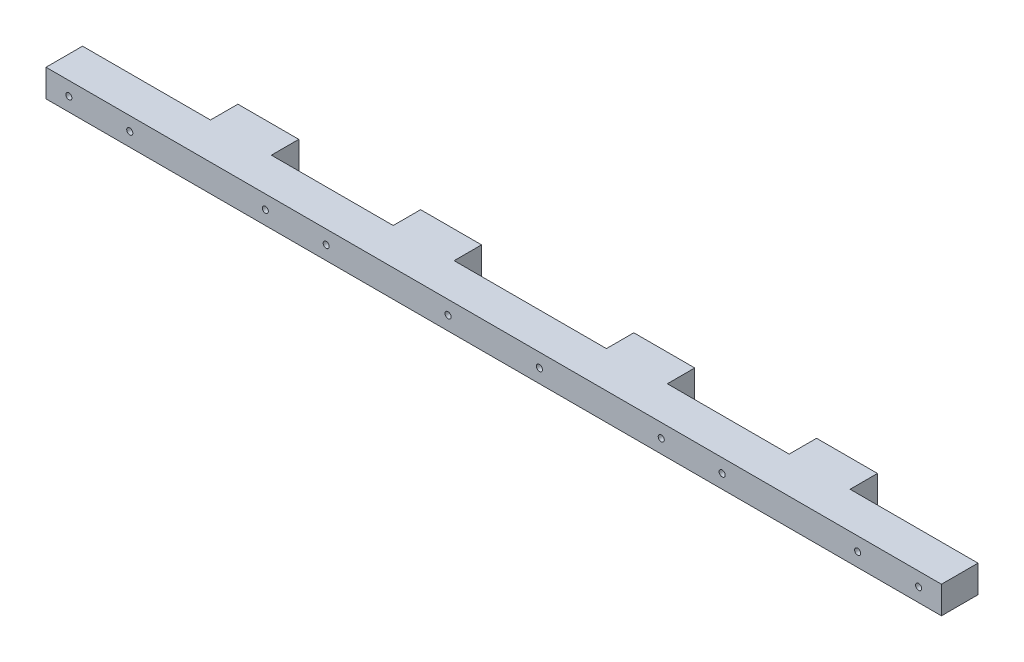
ISO-10303-21;
HEADER;
FILE_DESCRIPTION(('STEP AP214'),'2;1');
FILE_NAME('part.step','',(''),(''),'','','');
FILE_SCHEMA(('AUTOMOTIVE_DESIGN { 1 0 10303 214 1 1 1 1 }'));
ENDSEC;
DATA;
#1=APPLICATION_CONTEXT('core data for automotive mechanical design processes');
#2=APPLICATION_PROTOCOL_DEFINITION('international standard','automotive_design',2000,#1);
#3=PRODUCT_CONTEXT('',#1,'mechanical');
#4=PRODUCT('Part','Part','',(#3));
#5=PRODUCT_RELATED_PRODUCT_CATEGORY('part','',(#4));
#6=PRODUCT_DEFINITION_FORMATION('','',#4);
#7=PRODUCT_DEFINITION_CONTEXT('part definition',#1,'design');
#8=PRODUCT_DEFINITION('design','',#6,#7);
#9=PRODUCT_DEFINITION_SHAPE('','',#8);
#10=(LENGTH_UNIT() NAMED_UNIT(*) SI_UNIT(.MILLI.,.METRE.));
#11=(NAMED_UNIT(*) PLANE_ANGLE_UNIT() SI_UNIT($,.RADIAN.));
#12=(NAMED_UNIT(*) SI_UNIT($,.STERADIAN.) SOLID_ANGLE_UNIT());
#13=UNCERTAINTY_MEASURE_WITH_UNIT(LENGTH_MEASURE(1.E-05),#10,'distance_accuracy_value','');
#14=(GEOMETRIC_REPRESENTATION_CONTEXT(3) GLOBAL_UNCERTAINTY_ASSIGNED_CONTEXT((#13)) GLOBAL_UNIT_ASSIGNED_CONTEXT((#10,
#11,#12)) REPRESENTATION_CONTEXT('',''));
#15=CARTESIAN_POINT('',(0.,0.,0.));
#16=DIRECTION('',(0.,0.,1.));
#17=DIRECTION('',(1.,0.,0.));
#18=AXIS2_PLACEMENT_3D('',#15,#16,#17);
#19=CARTESIAN_POINT('',(0.,0.,9.));
#20=DIRECTION('',(0.,0.,-1.));
#21=DIRECTION('',(-1.,0.,0.));
#22=AXIS2_PLACEMENT_3D('',#19,#20,#21);
#23=PLANE('',#22);
#24=CARTESIAN_POINT('',(-139.5,10.5,9.));
#25=DIRECTION('',(0.,0.,1.));
#26=DIRECTION('',(1.,0.,0.));
#27=AXIS2_PLACEMENT_3D('',#24,#25,#26);
#28=CIRCLE('',#27,0.999999999999998);
#29=CARTESIAN_POINT('',(-138.5,10.5,9.));
#30=VERTEX_POINT('',#29);
#31=EDGE_CURVE('E324',#30,#30,#28,.T.);
#32=ORIENTED_EDGE('',*,*,#31,.T.);
#33=EDGE_LOOP('',(#32));
#34=FACE_BOUND('',#33,.T.);
#35=CARTESIAN_POINT('',(-119.5,10.5,9.));
#36=DIRECTION('',(0.,0.,1.));
#37=DIRECTION('',(1.,0.,0.));
#38=AXIS2_PLACEMENT_3D('',#35,#36,#37);
#39=CIRCLE('',#38,0.999999999999998);
#40=CARTESIAN_POINT('',(-118.5,10.5,9.));
#41=VERTEX_POINT('',#40);
#42=EDGE_CURVE('E301',#41,#41,#39,.T.);
#43=ORIENTED_EDGE('',*,*,#42,.T.);
#44=EDGE_LOOP('',(#43));
#45=FACE_BOUND('',#44,.T.);
#46=DIRECTION('',(-1.,0.,0.));
#47=VECTOR('',#46,1.);
#48=CARTESIAN_POINT('',(0.,15.,9.));
#49=LINE('',#48,#47);
#50=CARTESIAN_POINT('',(-105.,15.,9.));
#51=VERTEX_POINT('',#50);
#52=CARTESIAN_POINT('',(-147.,15.,9.));
#53=VERTEX_POINT('',#52);
#54=EDGE_CURVE('E291',#51,#53,#49,.T.);
#55=ORIENTED_EDGE('',*,*,#54,.F.);
#56=DIRECTION('',(0.,1.,0.));
#57=VECTOR('',#56,1.);
#58=CARTESIAN_POINT('',(-105.,0.,9.));
#59=LINE('',#58,#57);
#60=CARTESIAN_POINT('',(-105.,5.99999999999998,9.));
#61=VERTEX_POINT('',#60);
#62=EDGE_CURVE('E176',#61,#51,#59,.T.);
#63=ORIENTED_EDGE('',*,*,#62,.F.);
#64=DIRECTION('',(-1.,0.,0.));
#65=VECTOR('',#64,1.);
#66=CARTESIAN_POINT('',(0.,5.99999999999998,9.));
#67=LINE('',#66,#65);
#68=CARTESIAN_POINT('',(-147.,5.99999999999998,9.));
#69=VERTEX_POINT('',#68);
#70=EDGE_CURVE('E300',#61,#69,#67,.T.);
#71=ORIENTED_EDGE('',*,*,#70,.T.);
#72=DIRECTION('',(0.,1.,0.));
#73=VECTOR('',#72,1.);
#74=CARTESIAN_POINT('',(-147.,-4.53341068388605E-13,9.));
#75=LINE('',#74,#73);
#76=EDGE_CURVE('E292',#69,#53,#75,.T.);
#77=ORIENTED_EDGE('',*,*,#76,.T.);
#78=EDGE_LOOP('',(#55,#63,#71,#77));
#79=FACE_BOUND('',#78,.T.);
#80=ADVANCED_FACE('F35',(#34,#45,#79),#23,.T.);
#81=DIRECTION('',(0.,1.,0.));
#82=VECTOR('',#81,1.);
#83=CARTESIAN_POINT('',(-84.9999999999999,0.,9.));
#84=LINE('',#83,#82);
#85=CARTESIAN_POINT('',(-84.9999999999999,5.99999999999998,9.00000000000001));
#86=VERTEX_POINT('',#85);
#87=CARTESIAN_POINT('',(-84.9999999999999,15.,9.));
#88=VERTEX_POINT('',#87);
#89=EDGE_CURVE('E203',#86,#88,#84,.T.);
#90=ORIENTED_EDGE('',*,*,#89,.T.);
#91=CARTESIAN_POINT('',(-44.9999999999999,15.,9.));
#92=VERTEX_POINT('',#91);
#93=EDGE_CURVE('E861',#92,#88,#49,.T.);
#94=ORIENTED_EDGE('',*,*,#93,.F.);
#95=DIRECTION('',(0.,1.,0.));
#96=VECTOR('',#95,1.);
#97=CARTESIAN_POINT('',(-44.9999999999999,0.,9.));
#98=LINE('',#97,#96);
#99=CARTESIAN_POINT('',(-44.9999999999999,5.99999999999998,9.00000000000001));
#100=VERTEX_POINT('',#99);
#101=EDGE_CURVE('E58',#100,#92,#98,.T.);
#102=ORIENTED_EDGE('',*,*,#101,.F.);
#103=EDGE_CURVE('E869',#100,#86,#67,.T.);
#104=ORIENTED_EDGE('',*,*,#103,.T.);
#105=EDGE_LOOP('',(#90,#94,#102,#104));
#106=FACE_BOUND('',#105,.T.);
#107=CARTESIAN_POINT('',(-54.9999999999999,10.5,9.));
#108=DIRECTION('',(0.,0.,1.));
#109=DIRECTION('',(1.,0.,0.));
#110=AXIS2_PLACEMENT_3D('',#107,#108,#109);
#111=CIRCLE('',#110,0.999999999999998);
#112=CARTESIAN_POINT('',(-53.9999999999999,10.5,9.));
#113=VERTEX_POINT('',#112);
#114=EDGE_CURVE('E304',#113,#113,#111,.T.);
#115=ORIENTED_EDGE('',*,*,#114,.T.);
#116=EDGE_LOOP('',(#115));
#117=FACE_BOUND('',#116,.T.);
#118=CARTESIAN_POINT('',(-74.9999999999999,10.5,9.));
#119=DIRECTION('',(0.,0.,1.));
#120=DIRECTION('',(1.,0.,0.));
#121=AXIS2_PLACEMENT_3D('',#118,#119,#120);
#122=CIRCLE('',#121,0.999999999999998);
#123=CARTESIAN_POINT('',(-73.9999999999999,10.5,9.));
#124=VERTEX_POINT('',#123);
#125=EDGE_CURVE('E295',#124,#124,#122,.T.);
#126=ORIENTED_EDGE('',*,*,#125,.T.);
#127=EDGE_LOOP('',(#126));
#128=FACE_BOUND('',#127,.T.);
#129=ADVANCED_FACE('F403',(#106,#117,#128),#23,.T.);
#130=DIRECTION('',(0.,1.,0.));
#131=VECTOR('',#130,1.);
#132=CARTESIAN_POINT('',(-24.9999999999999,0.,9.));
#133=LINE('',#132,#131);
#134=CARTESIAN_POINT('',(-24.9999999999999,5.99999999999998,9.));
#135=VERTEX_POINT('',#134);
#136=CARTESIAN_POINT('',(-24.9999999999999,15.,9.));
#137=VERTEX_POINT('',#136);
#138=EDGE_CURVE('E208',#135,#137,#133,.T.);
#139=ORIENTED_EDGE('',*,*,#138,.T.);
#140=CARTESIAN_POINT('',(24.9999999999999,15.,9.));
#141=VERTEX_POINT('',#140);
#142=EDGE_CURVE('E853',#141,#137,#49,.T.);
#143=ORIENTED_EDGE('',*,*,#142,.F.);
#144=DIRECTION('',(0.,1.,0.));
#145=VECTOR('',#144,1.);
#146=CARTESIAN_POINT('',(24.9999999999999,0.,9.));
#147=LINE('',#146,#145);
#148=CARTESIAN_POINT('',(24.9999999999999,5.99999999999998,9.00000000000001));
#149=VERTEX_POINT('',#148);
#150=EDGE_CURVE('E231',#149,#141,#147,.T.);
#151=ORIENTED_EDGE('',*,*,#150,.F.);
#152=EDGE_CURVE('E855',#149,#135,#67,.T.);
#153=ORIENTED_EDGE('',*,*,#152,.T.);
#154=EDGE_LOOP('',(#139,#143,#151,#153));
#155=FACE_BOUND('',#154,.T.);
#156=CARTESIAN_POINT('',(-14.9999999999999,10.5,9.));
#157=DIRECTION('',(0.,0.,1.));
#158=DIRECTION('',(1.,0.,0.));
#159=AXIS2_PLACEMENT_3D('',#156,#157,#158);
#160=CIRCLE('',#159,1.);
#161=CARTESIAN_POINT('',(-13.9999999999999,10.5,9.));
#162=VERTEX_POINT('',#161);
#163=EDGE_CURVE('E313',#162,#162,#160,.T.);
#164=ORIENTED_EDGE('',*,*,#163,.T.);
#165=EDGE_LOOP('',(#164));
#166=FACE_BOUND('',#165,.T.);
#167=CARTESIAN_POINT('',(14.9999999999999,10.5,9.));
#168=DIRECTION('',(0.,0.,1.));
#169=DIRECTION('',(1.,0.,0.));
#170=AXIS2_PLACEMENT_3D('',#167,#168,#169);
#171=CIRCLE('',#170,1.);
#172=CARTESIAN_POINT('',(15.9999999999999,10.5,9.));
#173=VERTEX_POINT('',#172);
#174=EDGE_CURVE('E316',#173,#173,#171,.T.);
#175=ORIENTED_EDGE('',*,*,#174,.T.);
#176=EDGE_LOOP('',(#175));
#177=FACE_BOUND('',#176,.T.);
#178=ADVANCED_FACE('F408',(#155,#166,#177),#23,.T.);
#179=CARTESIAN_POINT('',(119.5,10.5,9.));
#180=DIRECTION('',(0.,0.,1.));
#181=DIRECTION('',(1.,0.,0.));
#182=AXIS2_PLACEMENT_3D('',#179,#180,#181);
#183=CIRCLE('',#182,0.999999999999998);
#184=CARTESIAN_POINT('',(120.5,10.5,9.));
#185=VERTEX_POINT('',#184);
#186=EDGE_CURVE('E307',#185,#185,#183,.T.);
#187=ORIENTED_EDGE('',*,*,#186,.T.);
#188=EDGE_LOOP('',(#187));
#189=FACE_BOUND('',#188,.T.);
#190=CARTESIAN_POINT('',(139.5,10.5,9.));
#191=DIRECTION('',(0.,0.,1.));
#192=DIRECTION('',(1.,0.,0.));
#193=AXIS2_PLACEMENT_3D('',#190,#191,#192);
#194=CIRCLE('',#193,0.999999999999998);
#195=CARTESIAN_POINT('',(140.5,10.5,9.));
#196=VERTEX_POINT('',#195);
#197=EDGE_CURVE('E310',#196,#196,#194,.T.);
#198=ORIENTED_EDGE('',*,*,#197,.T.);
#199=EDGE_LOOP('',(#198));
#200=FACE_BOUND('',#199,.T.);
#201=CARTESIAN_POINT('',(147.,5.99999999999997,9.));
#202=VERTEX_POINT('',#201);
#203=CARTESIAN_POINT('',(105.,5.99999999999997,9.00000000000001));
#204=VERTEX_POINT('',#203);
#205=EDGE_CURVE('E296',#202,#204,#67,.T.);
#206=ORIENTED_EDGE('',*,*,#205,.T.);
#207=DIRECTION('',(0.,1.,0.));
#208=VECTOR('',#207,1.);
#209=CARTESIAN_POINT('',(105.,0.,9.));
#210=LINE('',#209,#208);
#211=CARTESIAN_POINT('',(105.,15.,9.));
#212=VERTEX_POINT('',#211);
#213=EDGE_CURVE('E258',#204,#212,#210,.T.);
#214=ORIENTED_EDGE('',*,*,#213,.T.);
#215=CARTESIAN_POINT('',(147.,15.,9.));
#216=VERTEX_POINT('',#215);
#217=EDGE_CURVE('E286',#216,#212,#49,.T.);
#218=ORIENTED_EDGE('',*,*,#217,.F.);
#219=DIRECTION('',(0.,1.,0.));
#220=VECTOR('',#219,1.);
#221=CARTESIAN_POINT('',(147.,0.,9.));
#222=LINE('',#221,#220);
#223=EDGE_CURVE('E281',#202,#216,#222,.T.);
#224=ORIENTED_EDGE('',*,*,#223,.F.);
#225=EDGE_LOOP('',(#206,#214,#218,#224));
#226=FACE_BOUND('',#225,.T.);
#227=ADVANCED_FACE('F386',(#189,#200,#226),#23,.T.);
#228=DIRECTION('',(0.,1.,0.));
#229=VECTOR('',#228,1.);
#230=CARTESIAN_POINT('',(45.,0.,9.));
#231=LINE('',#230,#229);
#232=CARTESIAN_POINT('',(44.9999999999999,5.99999999999998,9.));
#233=VERTEX_POINT('',#232);
#234=CARTESIAN_POINT('',(44.9999999999999,15.,9.));
#235=VERTEX_POINT('',#234);
#236=EDGE_CURVE('E233',#233,#235,#231,.T.);
#237=ORIENTED_EDGE('',*,*,#236,.T.);
#238=CARTESIAN_POINT('',(84.9999999999999,15.,9.));
#239=VERTEX_POINT('',#238);
#240=EDGE_CURVE('E290',#239,#235,#49,.T.);
#241=ORIENTED_EDGE('',*,*,#240,.F.);
#242=DIRECTION('',(0.,1.,0.));
#243=VECTOR('',#242,1.);
#244=CARTESIAN_POINT('',(85.,0.,9.));
#245=LINE('',#244,#243);
#246=CARTESIAN_POINT('',(84.9999999999999,5.99999999999997,9.));
#247=VERTEX_POINT('',#246);
#248=EDGE_CURVE('E256',#247,#239,#245,.T.);
#249=ORIENTED_EDGE('',*,*,#248,.F.);
#250=EDGE_CURVE('E299',#247,#233,#67,.T.);
#251=ORIENTED_EDGE('',*,*,#250,.T.);
#252=EDGE_LOOP('',(#237,#241,#249,#251));
#253=FACE_BOUND('',#252,.T.);
#254=CARTESIAN_POINT('',(74.9999999999999,10.5,9.));
#255=DIRECTION('',(0.,0.,1.));
#256=DIRECTION('',(1.,0.,0.));
#257=AXIS2_PLACEMENT_3D('',#254,#255,#256);
#258=CIRCLE('',#257,0.999999999999998);
#259=CARTESIAN_POINT('',(75.9999999999999,10.5,9.));
#260=VERTEX_POINT('',#259);
#261=EDGE_CURVE('E280',#260,#260,#258,.T.);
#262=ORIENTED_EDGE('',*,*,#261,.T.);
#263=EDGE_LOOP('',(#262));
#264=FACE_BOUND('',#263,.T.);
#265=CARTESIAN_POINT('',(54.9999999999999,10.5,9.));
#266=DIRECTION('',(0.,0.,1.));
#267=DIRECTION('',(1.,0.,0.));
#268=AXIS2_PLACEMENT_3D('',#265,#266,#267);
#269=CIRCLE('',#268,0.999999999999998);
#270=CARTESIAN_POINT('',(55.9999999999999,10.5,9.));
#271=VERTEX_POINT('',#270);
#272=EDGE_CURVE('E319',#271,#271,#269,.T.);
#273=ORIENTED_EDGE('',*,*,#272,.T.);
#274=EDGE_LOOP('',(#273));
#275=FACE_BOUND('',#274,.T.);
#276=ADVANCED_FACE('F382',(#253,#264,#275),#23,.T.);
#277=CARTESIAN_POINT('',(0.,5.99999999999998,315.137722844249));
#278=DIRECTION('',(0.,-1.,0.));
#279=DIRECTION('',(1.,0.,0.));
#280=AXIS2_PLACEMENT_3D('',#277,#278,#279);
#281=PLANE('',#280);
#282=DIRECTION('',(1.,0.,0.));
#283=VECTOR('',#282,1.);
#284=CARTESIAN_POINT('',(0.,5.99999999999998,21.));
#285=LINE('',#284,#283);
#286=CARTESIAN_POINT('',(-147.,5.99999999999998,21.));
#287=VERTEX_POINT('',#286);
#288=CARTESIAN_POINT('',(147.,5.99999999999997,21.));
#289=VERTEX_POINT('',#288);
#290=EDGE_CURVE('E336',#287,#289,#285,.T.);
#291=ORIENTED_EDGE('',*,*,#290,.F.);
#292=DIRECTION('',(0.,0.,-1.));
#293=VECTOR('',#292,1.);
#294=CARTESIAN_POINT('',(-147.,5.99999999999998,315.137722844249));
#295=LINE('',#294,#293);
#296=EDGE_CURVE('E329',#287,#69,#295,.T.);
#297=ORIENTED_EDGE('',*,*,#296,.T.);
#298=ORIENTED_EDGE('',*,*,#70,.F.);
#299=DIRECTION('',(0.,0.,-1.));
#300=VECTOR('',#299,1.);
#301=CARTESIAN_POINT('',(-105.,5.99999999999998,30.9317121994613));
#302=LINE('',#301,#300);
#303=CARTESIAN_POINT('',(-105.,5.99999999999998,0.));
#304=VERTEX_POINT('',#303);
#305=EDGE_CURVE('E178',#61,#304,#302,.T.);
#306=ORIENTED_EDGE('',*,*,#305,.T.);
#307=DIRECTION('',(1.,0.,0.));
#308=VECTOR('',#307,1.);
#309=CARTESIAN_POINT('',(0.,5.99999999999998,0.));
#310=LINE('',#309,#308);
#311=CARTESIAN_POINT('',(-84.9999999999999,5.99999999999998,0.));
#312=VERTEX_POINT('',#311);
#313=EDGE_CURVE('E187',#304,#312,#310,.T.);
#314=ORIENTED_EDGE('',*,*,#313,.T.);
#315=DIRECTION('',(0.,0.,-1.));
#316=VECTOR('',#315,1.);
#317=CARTESIAN_POINT('',(-84.9999999999999,5.99999999999998,30.9317121994613));
#318=LINE('',#317,#316);
#319=EDGE_CURVE('E200',#86,#312,#318,.T.);
#320=ORIENTED_EDGE('',*,*,#319,.F.);
#321=ORIENTED_EDGE('',*,*,#103,.F.);
#322=DIRECTION('',(0.,0.,-1.));
#323=VECTOR('',#322,1.);
#324=CARTESIAN_POINT('',(-44.9999999999999,5.99999999999998,30.9317121994613));
#325=LINE('',#324,#323);
#326=CARTESIAN_POINT('',(-44.9999999999999,5.99999999999998,0.));
#327=VERTEX_POINT('',#326);
#328=EDGE_CURVE('E226',#100,#327,#325,.T.);
#329=ORIENTED_EDGE('',*,*,#328,.T.);
#330=DIRECTION('',(1.,0.,0.));
#331=VECTOR('',#330,1.);
#332=CARTESIAN_POINT('',(0.,5.99999999999998,0.));
#333=LINE('',#332,#331);
#334=CARTESIAN_POINT('',(-24.9999999999999,5.99999999999998,0.));
#335=VERTEX_POINT('',#334);
#336=EDGE_CURVE('E221',#327,#335,#333,.T.);
#337=ORIENTED_EDGE('',*,*,#336,.T.);
#338=DIRECTION('',(0.,0.,-1.));
#339=VECTOR('',#338,1.);
#340=CARTESIAN_POINT('',(-24.9999999999999,5.99999999999998,30.9317121994613));
#341=LINE('',#340,#339);
#342=EDGE_CURVE('E224',#135,#335,#341,.T.);
#343=ORIENTED_EDGE('',*,*,#342,.F.);
#344=ORIENTED_EDGE('',*,*,#152,.F.);
#345=DIRECTION('',(0.,0.,-1.));
#346=VECTOR('',#345,1.);
#347=CARTESIAN_POINT('',(24.9999999999999,5.99999999999998,30.9317121994613));
#348=LINE('',#347,#346);
#349=CARTESIAN_POINT('',(24.9999999999999,5.99999999999998,0.));
#350=VERTEX_POINT('',#349);
#351=EDGE_CURVE('E251',#149,#350,#348,.T.);
#352=ORIENTED_EDGE('',*,*,#351,.T.);
#353=DIRECTION('',(1.,0.,0.));
#354=VECTOR('',#353,1.);
#355=CARTESIAN_POINT('',(0.,5.99999999999998,0.));
#356=LINE('',#355,#354);
#357=CARTESIAN_POINT('',(44.9999999999999,5.99999999999998,0.));
#358=VERTEX_POINT('',#357);
#359=EDGE_CURVE('E246',#350,#358,#356,.T.);
#360=ORIENTED_EDGE('',*,*,#359,.T.);
#361=DIRECTION('',(0.,0.,-1.));
#362=VECTOR('',#361,1.);
#363=CARTESIAN_POINT('',(44.9999999999999,5.99999999999998,30.9317121994613));
#364=LINE('',#363,#362);
#365=EDGE_CURVE('E249',#233,#358,#364,.T.);
#366=ORIENTED_EDGE('',*,*,#365,.F.);
#367=ORIENTED_EDGE('',*,*,#250,.F.);
#368=DIRECTION('',(0.,0.,-1.));
#369=VECTOR('',#368,1.);
#370=CARTESIAN_POINT('',(84.9999999999999,5.99999999999997,30.9317121994613));
#371=LINE('',#370,#369);
#372=CARTESIAN_POINT('',(84.9999999999999,5.99999999999997,0.));
#373=VERTEX_POINT('',#372);
#374=EDGE_CURVE('E275',#247,#373,#371,.T.);
#375=ORIENTED_EDGE('',*,*,#374,.T.);
#376=DIRECTION('',(1.,0.,0.));
#377=VECTOR('',#376,1.);
#378=CARTESIAN_POINT('',(0.,5.99999999999998,0.));
#379=LINE('',#378,#377);
#380=CARTESIAN_POINT('',(105.,5.99999999999997,0.));
#381=VERTEX_POINT('',#380);
#382=EDGE_CURVE('E265',#373,#381,#379,.T.);
#383=ORIENTED_EDGE('',*,*,#382,.T.);
#384=DIRECTION('',(0.,0.,-1.));
#385=VECTOR('',#384,1.);
#386=CARTESIAN_POINT('',(105.,5.99999999999997,30.9317121994613));
#387=LINE('',#386,#385);
#388=EDGE_CURVE('E273',#204,#381,#387,.T.);
#389=ORIENTED_EDGE('',*,*,#388,.F.);
#390=ORIENTED_EDGE('',*,*,#205,.F.);
#391=DIRECTION('',(0.,0.,-1.));
#392=VECTOR('',#391,1.);
#393=CARTESIAN_POINT('',(147.,5.99999999999997,315.137722844249));
#394=LINE('',#393,#392);
#395=EDGE_CURVE('E285',#289,#202,#394,.T.);
#396=ORIENTED_EDGE('',*,*,#395,.F.);
#397=EDGE_LOOP('',(#291,#297,#298,#306,#314,#320,#321,#329,#337,#343,#344,#352,#360,#366,#367,
#375,#383,#389,#390,#396));
#398=FACE_BOUND('',#397,.T.);
#399=ADVANCED_FACE('F385',(#398),#281,.T.);
#400=CARTESIAN_POINT('',(147.,0.,315.137722844249));
#401=DIRECTION('',(-1.,0.,0.));
#402=DIRECTION('',(0.,0.,1.));
#403=AXIS2_PLACEMENT_3D('',#400,#401,#402);
#404=PLANE('',#403);
#405=DIRECTION('',(0.,0.,-1.));
#406=VECTOR('',#405,1.);
#407=CARTESIAN_POINT('',(147.,15.,315.137722844249));
#408=LINE('',#407,#406);
#409=CARTESIAN_POINT('',(147.,15.,21.));
#410=VERTEX_POINT('',#409);
#411=EDGE_CURVE('E332',#410,#216,#408,.T.);
#412=ORIENTED_EDGE('',*,*,#411,.F.);
#413=DIRECTION('',(0.,-1.,0.));
#414=VECTOR('',#413,1.);
#415=CARTESIAN_POINT('',(147.,0.,21.));
#416=LINE('',#415,#414);
#417=EDGE_CURVE('E331',#410,#289,#416,.T.);
#418=ORIENTED_EDGE('',*,*,#417,.T.);
#419=ORIENTED_EDGE('',*,*,#395,.T.);
#420=ORIENTED_EDGE('',*,*,#223,.T.);
#421=EDGE_LOOP('',(#412,#418,#419,#420));
#422=FACE_BOUND('',#421,.T.);
#423=ADVANCED_FACE('F621',(#422),#404,.F.);
#424=CARTESIAN_POINT('',(0.,15.,315.137722844249));
#425=DIRECTION('',(0.,-1.,0.));
#426=DIRECTION('',(1.,0.,0.));
#427=AXIS2_PLACEMENT_3D('',#424,#425,#426);
#428=PLANE('',#427);
#429=DIRECTION('',(0.,0.,-1.));
#430=VECTOR('',#429,1.);
#431=CARTESIAN_POINT('',(-147.,15.,315.137722844249));
#432=LINE('',#431,#430);
#433=CARTESIAN_POINT('',(-147.,15.,21.));
#434=VERTEX_POINT('',#433);
#435=EDGE_CURVE('E289',#434,#53,#432,.T.);
#436=ORIENTED_EDGE('',*,*,#435,.F.);
#437=DIRECTION('',(1.,0.,0.));
#438=VECTOR('',#437,1.);
#439=CARTESIAN_POINT('',(0.,15.,21.));
#440=LINE('',#439,#438);
#441=EDGE_CURVE('E284',#434,#410,#440,.T.);
#442=ORIENTED_EDGE('',*,*,#441,.T.);
#443=ORIENTED_EDGE('',*,*,#411,.T.);
#444=ORIENTED_EDGE('',*,*,#217,.T.);
#445=DIRECTION('',(0.,0.,-1.));
#446=VECTOR('',#445,1.);
#447=CARTESIAN_POINT('',(105.,15.,30.9317121994613));
#448=LINE('',#447,#446);
#449=CARTESIAN_POINT('',(105.,15.,0.));
#450=VERTEX_POINT('',#449);
#451=EDGE_CURVE('E271',#212,#450,#448,.T.);
#452=ORIENTED_EDGE('',*,*,#451,.T.);
#453=DIRECTION('',(-1.,0.,0.));
#454=VECTOR('',#453,1.);
#455=CARTESIAN_POINT('',(0.,15.,0.));
#456=LINE('',#455,#454);
#457=CARTESIAN_POINT('',(84.9999999999999,15.,0.));
#458=VERTEX_POINT('',#457);
#459=EDGE_CURVE('E237',#450,#458,#456,.T.);
#460=ORIENTED_EDGE('',*,*,#459,.T.);
#461=DIRECTION('',(0.,0.,-1.));
#462=VECTOR('',#461,1.);
#463=CARTESIAN_POINT('',(84.9999999999999,15.,30.9317121994613));
#464=LINE('',#463,#462);
#465=EDGE_CURVE('E259',#239,#458,#464,.T.);
#466=ORIENTED_EDGE('',*,*,#465,.F.);
#467=ORIENTED_EDGE('',*,*,#240,.T.);
#468=DIRECTION('',(0.,0.,-1.));
#469=VECTOR('',#468,1.);
#470=CARTESIAN_POINT('',(44.9999999999999,15.,30.9317121994613));
#471=LINE('',#470,#469);
#472=CARTESIAN_POINT('',(44.9999999999999,15.,0.));
#473=VERTEX_POINT('',#472);
#474=EDGE_CURVE('E234',#235,#473,#471,.T.);
#475=ORIENTED_EDGE('',*,*,#474,.T.);
#476=DIRECTION('',(1.,0.,0.));
#477=VECTOR('',#476,1.);
#478=CARTESIAN_POINT('',(0.,15.,0.));
#479=LINE('',#478,#477);
#480=CARTESIAN_POINT('',(24.9999999999999,15.,0.));
#481=VERTEX_POINT('',#480);
#482=EDGE_CURVE('E240',#481,#473,#479,.T.);
#483=ORIENTED_EDGE('',*,*,#482,.F.);
#484=DIRECTION('',(0.,0.,-1.));
#485=VECTOR('',#484,1.);
#486=CARTESIAN_POINT('',(24.9999999999999,15.,30.9317121994613));
#487=LINE('',#486,#485);
#488=EDGE_CURVE('E253',#141,#481,#487,.T.);
#489=ORIENTED_EDGE('',*,*,#488,.F.);
#490=ORIENTED_EDGE('',*,*,#142,.T.);
#491=DIRECTION('',(0.,0.,-1.));
#492=VECTOR('',#491,1.);
#493=CARTESIAN_POINT('',(-24.9999999999999,15.,30.9317121994613));
#494=LINE('',#493,#492);
#495=CARTESIAN_POINT('',(-24.9999999999999,15.,0.));
#496=VERTEX_POINT('',#495);
#497=EDGE_CURVE('E209',#137,#496,#494,.T.);
#498=ORIENTED_EDGE('',*,*,#497,.T.);
#499=DIRECTION('',(1.,0.,0.));
#500=VECTOR('',#499,1.);
#501=CARTESIAN_POINT('',(0.,15.,0.));
#502=LINE('',#501,#500);
#503=CARTESIAN_POINT('',(-44.9999999999999,15.,0.));
#504=VERTEX_POINT('',#503);
#505=EDGE_CURVE('E215',#504,#496,#502,.T.);
#506=ORIENTED_EDGE('',*,*,#505,.F.);
#507=DIRECTION('',(0.,0.,-1.));
#508=VECTOR('',#507,1.);
#509=CARTESIAN_POINT('',(-44.9999999999999,15.,30.9317121994613));
#510=LINE('',#509,#508);
#511=EDGE_CURVE('E228',#92,#504,#510,.T.);
#512=ORIENTED_EDGE('',*,*,#511,.F.);
#513=ORIENTED_EDGE('',*,*,#93,.T.);
#514=DIRECTION('',(0.,0.,-1.));
#515=VECTOR('',#514,1.);
#516=CARTESIAN_POINT('',(-84.9999999999999,15.,30.9317121994613));
#517=LINE('',#516,#515);
#518=CARTESIAN_POINT('',(-84.9999999999999,15.,0.));
#519=VERTEX_POINT('',#518);
#520=EDGE_CURVE('E192',#88,#519,#517,.T.);
#521=ORIENTED_EDGE('',*,*,#520,.T.);
#522=DIRECTION('',(1.,0.,0.));
#523=VECTOR('',#522,1.);
#524=CARTESIAN_POINT('',(0.,15.,0.));
#525=LINE('',#524,#523);
#526=CARTESIAN_POINT('',(-105.,15.,0.));
#527=VERTEX_POINT('',#526);
#528=EDGE_CURVE('E184',#527,#519,#525,.T.);
#529=ORIENTED_EDGE('',*,*,#528,.F.);
#530=DIRECTION('',(0.,0.,-1.));
#531=VECTOR('',#530,1.);
#532=CARTESIAN_POINT('',(-105.,15.,30.9317121994613));
#533=LINE('',#532,#531);
#534=EDGE_CURVE('E50',#51,#527,#533,.T.);
#535=ORIENTED_EDGE('',*,*,#534,.F.);
#536=ORIENTED_EDGE('',*,*,#54,.T.);
#537=EDGE_LOOP('',(#436,#442,#443,#444,#452,#460,#466,#467,#475,#483,#489,#490,#498,#506,#512,
#513,#521,#529,#535,#536));
#538=FACE_BOUND('',#537,.T.);
#539=ADVANCED_FACE('F190',(#538),#428,.F.);
#540=CARTESIAN_POINT('',(-147.,-4.53341068388605E-13,315.137722844249));
#541=DIRECTION('',(-1.,0.,0.));
#542=DIRECTION('',(0.,-1.,0.));
#543=AXIS2_PLACEMENT_3D('',#540,#541,#542);
#544=PLANE('',#543);
#545=DIRECTION('',(0.,-1.,0.));
#546=VECTOR('',#545,1.);
#547=CARTESIAN_POINT('',(-147.,-4.53341068388605E-13,21.));
#548=LINE('',#547,#546);
#549=EDGE_CURVE('E340',#434,#287,#548,.T.);
#550=ORIENTED_EDGE('',*,*,#549,.F.);
#551=ORIENTED_EDGE('',*,*,#435,.T.);
#552=ORIENTED_EDGE('',*,*,#76,.F.);
#553=ORIENTED_EDGE('',*,*,#296,.F.);
#554=EDGE_LOOP('',(#550,#551,#552,#553));
#555=FACE_BOUND('',#554,.T.);
#556=ADVANCED_FACE('F602',(#555),#544,.T.);
#557=CARTESIAN_POINT('',(-119.5,10.5,315.137722844249));
#558=DIRECTION('',(0.,0.,-1.));
#559=DIRECTION('',(-1.,0.,0.));
#560=AXIS2_PLACEMENT_3D('',#557,#558,#559);
#561=CYLINDRICAL_SURFACE('',#560,0.999999999999998);
#562=CARTESIAN_POINT('',(-119.5,10.5,21.));
#563=DIRECTION('',(0.,0.,-1.));
#564=DIRECTION('',(-1.,0.,0.));
#565=AXIS2_PLACEMENT_3D('',#562,#563,#564);
#566=CIRCLE('',#565,0.999999999999998);
#567=CARTESIAN_POINT('',(-120.5,10.5,21.));
#568=VERTEX_POINT('',#567);
#569=EDGE_CURVE('E346',#568,#568,#566,.T.);
#570=ORIENTED_EDGE('',*,*,#569,.F.);
#571=EDGE_LOOP('',(#570));
#572=FACE_BOUND('',#571,.T.);
#573=ORIENTED_EDGE('',*,*,#42,.F.);
#574=EDGE_LOOP('',(#573));
#575=FACE_BOUND('',#574,.T.);
#576=ADVANCED_FACE('F592',(#572,#575),#561,.F.);
#577=CARTESIAN_POINT('',(-74.9999999999999,10.5,315.137722844249));
#578=DIRECTION('',(0.,0.,-1.));
#579=DIRECTION('',(-1.,0.,0.));
#580=AXIS2_PLACEMENT_3D('',#577,#578,#579);
#581=CYLINDRICAL_SURFACE('',#580,0.999999999999998);
#582=CARTESIAN_POINT('',(-74.9999999999999,10.5,21.));
#583=DIRECTION('',(0.,0.,-1.));
#584=DIRECTION('',(-1.,0.,0.));
#585=AXIS2_PLACEMENT_3D('',#582,#583,#584);
#586=CIRCLE('',#585,0.999999999999998);
#587=CARTESIAN_POINT('',(-75.9999999999999,10.5,21.));
#588=VERTEX_POINT('',#587);
#589=EDGE_CURVE('E349',#588,#588,#586,.T.);
#590=ORIENTED_EDGE('',*,*,#589,.F.);
#591=EDGE_LOOP('',(#590));
#592=FACE_BOUND('',#591,.T.);
#593=ORIENTED_EDGE('',*,*,#125,.F.);
#594=EDGE_LOOP('',(#593));
#595=FACE_BOUND('',#594,.T.);
#596=ADVANCED_FACE('F582',(#592,#595),#581,.F.);
#597=CARTESIAN_POINT('',(-54.9999999999999,10.5,315.137722844249));
#598=DIRECTION('',(0.,0.,-1.));
#599=DIRECTION('',(-1.,0.,0.));
#600=AXIS2_PLACEMENT_3D('',#597,#598,#599);
#601=CYLINDRICAL_SURFACE('',#600,0.999999999999998);
#602=CARTESIAN_POINT('',(-54.9999999999999,10.5,21.));
#603=DIRECTION('',(0.,0.,-1.));
#604=DIRECTION('',(-1.,0.,0.));
#605=AXIS2_PLACEMENT_3D('',#602,#603,#604);
#606=CIRCLE('',#605,0.999999999999998);
#607=CARTESIAN_POINT('',(-55.9999999999999,10.5,21.));
#608=VERTEX_POINT('',#607);
#609=EDGE_CURVE('E352',#608,#608,#606,.T.);
#610=ORIENTED_EDGE('',*,*,#609,.F.);
#611=EDGE_LOOP('',(#610));
#612=FACE_BOUND('',#611,.T.);
#613=ORIENTED_EDGE('',*,*,#114,.F.);
#614=EDGE_LOOP('',(#613));
#615=FACE_BOUND('',#614,.T.);
#616=ADVANCED_FACE('F572',(#612,#615),#601,.F.);
#617=CARTESIAN_POINT('',(119.5,10.5,315.137722844249));
#618=DIRECTION('',(0.,0.,-1.));
#619=DIRECTION('',(-1.,0.,0.));
#620=AXIS2_PLACEMENT_3D('',#617,#618,#619);
#621=CYLINDRICAL_SURFACE('',#620,0.999999999999998);
#622=CARTESIAN_POINT('',(119.5,10.5,21.));
#623=DIRECTION('',(0.,0.,-1.));
#624=DIRECTION('',(-1.,0.,0.));
#625=AXIS2_PLACEMENT_3D('',#622,#623,#624);
#626=CIRCLE('',#625,0.999999999999998);
#627=CARTESIAN_POINT('',(118.5,10.5,21.));
#628=VERTEX_POINT('',#627);
#629=EDGE_CURVE('E355',#628,#628,#626,.T.);
#630=ORIENTED_EDGE('',*,*,#629,.F.);
#631=EDGE_LOOP('',(#630));
#632=FACE_BOUND('',#631,.T.);
#633=ORIENTED_EDGE('',*,*,#186,.F.);
#634=EDGE_LOOP('',(#633));
#635=FACE_BOUND('',#634,.T.);
#636=ADVANCED_FACE('F562',(#632,#635),#621,.F.);
#637=CARTESIAN_POINT('',(139.5,10.5,315.137722844249));
#638=DIRECTION('',(0.,0.,-1.));
#639=DIRECTION('',(-1.,0.,0.));
#640=AXIS2_PLACEMENT_3D('',#637,#638,#639);
#641=CYLINDRICAL_SURFACE('',#640,0.999999999999998);
#642=CARTESIAN_POINT('',(139.5,10.5,21.));
#643=DIRECTION('',(0.,0.,-1.));
#644=DIRECTION('',(-1.,0.,0.));
#645=AXIS2_PLACEMENT_3D('',#642,#643,#644);
#646=CIRCLE('',#645,0.999999999999998);
#647=CARTESIAN_POINT('',(138.5,10.5,21.));
#648=VERTEX_POINT('',#647);
#649=EDGE_CURVE('E358',#648,#648,#646,.T.);
#650=ORIENTED_EDGE('',*,*,#649,.F.);
#651=EDGE_LOOP('',(#650));
#652=FACE_BOUND('',#651,.T.);
#653=ORIENTED_EDGE('',*,*,#197,.F.);
#654=EDGE_LOOP('',(#653));
#655=FACE_BOUND('',#654,.T.);
#656=ADVANCED_FACE('F552',(#652,#655),#641,.F.);
#657=CARTESIAN_POINT('',(-14.9999999999999,10.5,315.137722844249));
#658=DIRECTION('',(0.,0.,-1.));
#659=DIRECTION('',(-1.,0.,0.));
#660=AXIS2_PLACEMENT_3D('',#657,#658,#659);
#661=CYLINDRICAL_SURFACE('',#660,1.);
#662=CARTESIAN_POINT('',(-14.9999999999999,10.5,21.));
#663=DIRECTION('',(0.,0.,-1.));
#664=DIRECTION('',(-1.,0.,0.));
#665=AXIS2_PLACEMENT_3D('',#662,#663,#664);
#666=CIRCLE('',#665,1.);
#667=CARTESIAN_POINT('',(-15.9999999999999,10.5,21.));
#668=VERTEX_POINT('',#667);
#669=EDGE_CURVE('E361',#668,#668,#666,.T.);
#670=ORIENTED_EDGE('',*,*,#669,.F.);
#671=EDGE_LOOP('',(#670));
#672=FACE_BOUND('',#671,.T.);
#673=ORIENTED_EDGE('',*,*,#163,.F.);
#674=EDGE_LOOP('',(#673));
#675=FACE_BOUND('',#674,.T.);
#676=ADVANCED_FACE('F398',(#672,#675),#661,.F.);
#677=CARTESIAN_POINT('',(14.9999999999999,10.5,315.137722844249));
#678=DIRECTION('',(0.,0.,-1.));
#679=DIRECTION('',(-1.,0.,0.));
#680=AXIS2_PLACEMENT_3D('',#677,#678,#679);
#681=CYLINDRICAL_SURFACE('',#680,1.);
#682=CARTESIAN_POINT('',(14.9999999999999,10.5,21.));
#683=DIRECTION('',(0.,0.,-1.));
#684=DIRECTION('',(-1.,0.,0.));
#685=AXIS2_PLACEMENT_3D('',#682,#683,#684);
#686=CIRCLE('',#685,1.);
#687=CARTESIAN_POINT('',(13.9999999999999,10.5,21.));
#688=VERTEX_POINT('',#687);
#689=EDGE_CURVE('E364',#688,#688,#686,.T.);
#690=ORIENTED_EDGE('',*,*,#689,.F.);
#691=EDGE_LOOP('',(#690));
#692=FACE_BOUND('',#691,.T.);
#693=ORIENTED_EDGE('',*,*,#174,.F.);
#694=EDGE_LOOP('',(#693));
#695=FACE_BOUND('',#694,.T.);
#696=ADVANCED_FACE('F392',(#692,#695),#681,.F.);
#697=CARTESIAN_POINT('',(54.9999999999999,10.5,315.137722844249));
#698=DIRECTION('',(0.,0.,-1.));
#699=DIRECTION('',(-1.,0.,0.));
#700=AXIS2_PLACEMENT_3D('',#697,#698,#699);
#701=CYLINDRICAL_SURFACE('',#700,0.999999999999998);
#702=CARTESIAN_POINT('',(54.9999999999999,10.5,21.));
#703=DIRECTION('',(0.,0.,-1.));
#704=DIRECTION('',(-1.,0.,0.));
#705=AXIS2_PLACEMENT_3D('',#702,#703,#704);
#706=CIRCLE('',#705,0.999999999999998);
#707=CARTESIAN_POINT('',(53.9999999999999,10.5,21.));
#708=VERTEX_POINT('',#707);
#709=EDGE_CURVE('E367',#708,#708,#706,.T.);
#710=ORIENTED_EDGE('',*,*,#709,.F.);
#711=EDGE_LOOP('',(#710));
#712=FACE_BOUND('',#711,.T.);
#713=ORIENTED_EDGE('',*,*,#272,.F.);
#714=EDGE_LOOP('',(#713));
#715=FACE_BOUND('',#714,.T.);
#716=ADVANCED_FACE('F378',(#712,#715),#701,.F.);
#717=CARTESIAN_POINT('',(74.9999999999999,10.5,315.137722844249));
#718=DIRECTION('',(0.,0.,-1.));
#719=DIRECTION('',(-1.,0.,0.));
#720=AXIS2_PLACEMENT_3D('',#717,#718,#719);
#721=CYLINDRICAL_SURFACE('',#720,0.999999999999998);
#722=CARTESIAN_POINT('',(74.9999999999999,10.5,21.));
#723=DIRECTION('',(0.,0.,-1.));
#724=DIRECTION('',(-1.,0.,0.));
#725=AXIS2_PLACEMENT_3D('',#722,#723,#724);
#726=CIRCLE('',#725,0.999999999999998);
#727=CARTESIAN_POINT('',(73.9999999999999,10.5,21.));
#728=VERTEX_POINT('',#727);
#729=EDGE_CURVE('E43',#728,#728,#726,.T.);
#730=ORIENTED_EDGE('',*,*,#729,.F.);
#731=EDGE_LOOP('',(#730));
#732=FACE_BOUND('',#731,.T.);
#733=ORIENTED_EDGE('',*,*,#261,.F.);
#734=EDGE_LOOP('',(#733));
#735=FACE_BOUND('',#734,.T.);
#736=ADVANCED_FACE('F374',(#732,#735),#721,.F.);
#737=CARTESIAN_POINT('',(-139.5,10.5,315.137722844249));
#738=DIRECTION('',(0.,0.,-1.));
#739=DIRECTION('',(-1.,0.,0.));
#740=AXIS2_PLACEMENT_3D('',#737,#738,#739);
#741=CYLINDRICAL_SURFACE('',#740,0.999999999999998);
#742=CARTESIAN_POINT('',(-139.5,10.5,21.));
#743=DIRECTION('',(0.,0.,-1.));
#744=DIRECTION('',(-1.,0.,0.));
#745=AXIS2_PLACEMENT_3D('',#742,#743,#744);
#746=CIRCLE('',#745,0.999999999999998);
#747=CARTESIAN_POINT('',(-140.5,10.5,21.));
#748=VERTEX_POINT('',#747);
#749=EDGE_CURVE('E11',#748,#748,#746,.T.);
#750=ORIENTED_EDGE('',*,*,#749,.F.);
#751=EDGE_LOOP('',(#750));
#752=FACE_BOUND('',#751,.T.);
#753=ORIENTED_EDGE('',*,*,#31,.F.);
#754=EDGE_LOOP('',(#753));
#755=FACE_BOUND('',#754,.T.);
#756=ADVANCED_FACE('F377',(#752,#755),#741,.F.);
#757=CARTESIAN_POINT('',(0.,0.,21.));
#758=DIRECTION('',(0.,0.,-1.));
#759=DIRECTION('',(-1.,0.,0.));
#760=AXIS2_PLACEMENT_3D('',#757,#758,#759);
#761=PLANE('',#760);
#762=ORIENTED_EDGE('',*,*,#290,.T.);
#763=ORIENTED_EDGE('',*,*,#417,.F.);
#764=ORIENTED_EDGE('',*,*,#441,.F.);
#765=ORIENTED_EDGE('',*,*,#549,.T.);
#766=EDGE_LOOP('',(#762,#763,#764,#765));
#767=FACE_BOUND('',#766,.T.);
#768=ORIENTED_EDGE('',*,*,#569,.T.);
#769=EDGE_LOOP('',(#768));
#770=FACE_BOUND('',#769,.T.);
#771=ORIENTED_EDGE('',*,*,#589,.T.);
#772=EDGE_LOOP('',(#771));
#773=FACE_BOUND('',#772,.T.);
#774=ORIENTED_EDGE('',*,*,#609,.T.);
#775=EDGE_LOOP('',(#774));
#776=FACE_BOUND('',#775,.T.);
#777=ORIENTED_EDGE('',*,*,#629,.T.);
#778=EDGE_LOOP('',(#777));
#779=FACE_BOUND('',#778,.T.);
#780=ORIENTED_EDGE('',*,*,#649,.T.);
#781=EDGE_LOOP('',(#780));
#782=FACE_BOUND('',#781,.T.);
#783=ORIENTED_EDGE('',*,*,#669,.T.);
#784=EDGE_LOOP('',(#783));
#785=FACE_BOUND('',#784,.T.);
#786=ORIENTED_EDGE('',*,*,#689,.T.);
#787=EDGE_LOOP('',(#786));
#788=FACE_BOUND('',#787,.T.);
#789=ORIENTED_EDGE('',*,*,#709,.T.);
#790=EDGE_LOOP('',(#789));
#791=FACE_BOUND('',#790,.T.);
#792=ORIENTED_EDGE('',*,*,#729,.T.);
#793=EDGE_LOOP('',(#792));
#794=FACE_BOUND('',#793,.T.);
#795=ORIENTED_EDGE('',*,*,#749,.T.);
#796=EDGE_LOOP('',(#795));
#797=FACE_BOUND('',#796,.T.);
#798=ADVANCED_FACE('F37',(#767,#770,#773,#776,#779,#782,#785,#788,#791,#794,#797),#761,.F.);
#799=CARTESIAN_POINT('',(85.,0.,30.9317121994613));
#800=DIRECTION('',(1.,0.,0.));
#801=DIRECTION('',(0.,1.,0.));
#802=AXIS2_PLACEMENT_3D('',#799,#800,#801);
#803=PLANE('',#802);
#804=ORIENTED_EDGE('',*,*,#374,.F.);
#805=ORIENTED_EDGE('',*,*,#248,.T.);
#806=ORIENTED_EDGE('',*,*,#465,.T.);
#807=DIRECTION('',(0.,-1.,0.));
#808=VECTOR('',#807,1.);
#809=CARTESIAN_POINT('',(85.,0.,0.));
#810=LINE('',#809,#808);
#811=EDGE_CURVE('E262',#458,#373,#810,.T.);
#812=ORIENTED_EDGE('',*,*,#811,.T.);
#813=EDGE_LOOP('',(#804,#805,#806,#812));
#814=FACE_BOUND('',#813,.T.);
#815=ADVANCED_FACE('F412',(#814),#803,.F.);
#816=CARTESIAN_POINT('',(105.,0.,30.9317121994613));
#817=DIRECTION('',(1.,0.,0.));
#818=DIRECTION('',(0.,0.,-1.));
#819=AXIS2_PLACEMENT_3D('',#816,#817,#818);
#820=PLANE('',#819);
#821=ORIENTED_EDGE('',*,*,#213,.F.);
#822=ORIENTED_EDGE('',*,*,#388,.T.);
#823=DIRECTION('',(0.,-1.,0.));
#824=VECTOR('',#823,1.);
#825=CARTESIAN_POINT('',(105.,0.,0.));
#826=LINE('',#825,#824);
#827=EDGE_CURVE('E268',#450,#381,#826,.T.);
#828=ORIENTED_EDGE('',*,*,#827,.F.);
#829=ORIENTED_EDGE('',*,*,#451,.F.);
#830=EDGE_LOOP('',(#821,#822,#828,#829));
#831=FACE_BOUND('',#830,.T.);
#832=ADVANCED_FACE('F415',(#831),#820,.T.);
#833=CARTESIAN_POINT('',(0.,0.,0.));
#834=DIRECTION('',(0.,0.,1.));
#835=DIRECTION('',(1.,0.,0.));
#836=AXIS2_PLACEMENT_3D('',#833,#834,#835);
#837=PLANE('',#836);
#838=ORIENTED_EDGE('',*,*,#459,.F.);
#839=ORIENTED_EDGE('',*,*,#827,.T.);
#840=ORIENTED_EDGE('',*,*,#382,.F.);
#841=ORIENTED_EDGE('',*,*,#811,.F.);
#842=EDGE_LOOP('',(#838,#839,#840,#841));
#843=FACE_BOUND('',#842,.T.);
#844=ADVANCED_FACE('F419',(#843),#837,.F.);
#845=CARTESIAN_POINT('',(0.,0.,0.));
#846=DIRECTION('',(0.,0.,1.));
#847=DIRECTION('',(1.,0.,0.));
#848=AXIS2_PLACEMENT_3D('',#845,#846,#847);
#849=PLANE('',#848);
#850=DIRECTION('',(0.,-1.,0.));
#851=VECTOR('',#850,1.);
#852=CARTESIAN_POINT('',(45.,0.,0.));
#853=LINE('',#852,#851);
#854=EDGE_CURVE('E212',#473,#358,#853,.T.);
#855=ORIENTED_EDGE('',*,*,#854,.T.);
#856=ORIENTED_EDGE('',*,*,#359,.F.);
#857=DIRECTION('',(0.,-1.,0.));
#858=VECTOR('',#857,1.);
#859=CARTESIAN_POINT('',(24.9999999999999,0.,0.));
#860=LINE('',#859,#858);
#861=EDGE_CURVE('E243',#481,#350,#860,.T.);
#862=ORIENTED_EDGE('',*,*,#861,.F.);
#863=ORIENTED_EDGE('',*,*,#482,.T.);
#864=EDGE_LOOP('',(#855,#856,#862,#863));
#865=FACE_BOUND('',#864,.T.);
#866=ADVANCED_FACE('F423',(#865),#849,.F.);
#867=CARTESIAN_POINT('',(24.9999999999999,0.,30.9317121994613));
#868=DIRECTION('',(1.,0.,0.));
#869=DIRECTION('',(0.,1.,0.));
#870=AXIS2_PLACEMENT_3D('',#867,#868,#869);
#871=PLANE('',#870);
#872=ORIENTED_EDGE('',*,*,#351,.F.);
#873=ORIENTED_EDGE('',*,*,#150,.T.);
#874=ORIENTED_EDGE('',*,*,#488,.T.);
#875=ORIENTED_EDGE('',*,*,#861,.T.);
#876=EDGE_LOOP('',(#872,#873,#874,#875));
#877=FACE_BOUND('',#876,.T.);
#878=ADVANCED_FACE('F429',(#877),#871,.F.);
#879=CARTESIAN_POINT('',(45.,0.,30.9317121994613));
#880=DIRECTION('',(1.,0.,0.));
#881=DIRECTION('',(0.,1.,0.));
#882=AXIS2_PLACEMENT_3D('',#879,#880,#881);
#883=PLANE('',#882);
#884=ORIENTED_EDGE('',*,*,#236,.F.);
#885=ORIENTED_EDGE('',*,*,#365,.T.);
#886=ORIENTED_EDGE('',*,*,#854,.F.);
#887=ORIENTED_EDGE('',*,*,#474,.F.);
#888=EDGE_LOOP('',(#884,#885,#886,#887));
#889=FACE_BOUND('',#888,.T.);
#890=ADVANCED_FACE('F425',(#889),#883,.T.);
#891=CARTESIAN_POINT('',(0.,0.,0.));
#892=DIRECTION('',(0.,0.,1.));
#893=DIRECTION('',(1.,0.,0.));
#894=AXIS2_PLACEMENT_3D('',#891,#892,#893);
#895=PLANE('',#894);
#896=DIRECTION('',(0.,-1.,0.));
#897=VECTOR('',#896,1.);
#898=CARTESIAN_POINT('',(-24.9999999999999,0.,0.));
#899=LINE('',#898,#897);
#900=EDGE_CURVE('E206',#496,#335,#899,.T.);
#901=ORIENTED_EDGE('',*,*,#900,.T.);
#902=ORIENTED_EDGE('',*,*,#336,.F.);
#903=DIRECTION('',(0.,-1.,0.));
#904=VECTOR('',#903,1.);
#905=CARTESIAN_POINT('',(-44.9999999999999,0.,0.));
#906=LINE('',#905,#904);
#907=EDGE_CURVE('E218',#504,#327,#906,.T.);
#908=ORIENTED_EDGE('',*,*,#907,.F.);
#909=ORIENTED_EDGE('',*,*,#505,.T.);
#910=EDGE_LOOP('',(#901,#902,#908,#909));
#911=FACE_BOUND('',#910,.T.);
#912=ADVANCED_FACE('F428',(#911),#895,.F.);
#913=CARTESIAN_POINT('',(-44.9999999999999,0.,30.9317121994613));
#914=DIRECTION('',(1.,0.,0.));
#915=DIRECTION('',(0.,1.,0.));
#916=AXIS2_PLACEMENT_3D('',#913,#914,#915);
#917=PLANE('',#916);
#918=ORIENTED_EDGE('',*,*,#328,.F.);
#919=ORIENTED_EDGE('',*,*,#101,.T.);
#920=ORIENTED_EDGE('',*,*,#511,.T.);
#921=ORIENTED_EDGE('',*,*,#907,.T.);
#922=EDGE_LOOP('',(#918,#919,#920,#921));
#923=FACE_BOUND('',#922,.T.);
#924=ADVANCED_FACE('F440',(#923),#917,.F.);
#925=CARTESIAN_POINT('',(-24.9999999999999,0.,30.9317121994613));
#926=DIRECTION('',(1.,0.,0.));
#927=DIRECTION('',(0.,0.,-1.));
#928=AXIS2_PLACEMENT_3D('',#925,#926,#927);
#929=PLANE('',#928);
#930=ORIENTED_EDGE('',*,*,#138,.F.);
#931=ORIENTED_EDGE('',*,*,#342,.T.);
#932=ORIENTED_EDGE('',*,*,#900,.F.);
#933=ORIENTED_EDGE('',*,*,#497,.F.);
#934=EDGE_LOOP('',(#930,#931,#932,#933));
#935=FACE_BOUND('',#934,.T.);
#936=ADVANCED_FACE('F437',(#935),#929,.T.);
#937=CARTESIAN_POINT('',(-105.,0.,30.9317121994613));
#938=DIRECTION('',(1.,0.,0.));
#939=DIRECTION('',(0.,0.,-1.));
#940=AXIS2_PLACEMENT_3D('',#937,#938,#939);
#941=PLANE('',#940);
#942=ORIENTED_EDGE('',*,*,#305,.F.);
#943=ORIENTED_EDGE('',*,*,#62,.T.);
#944=ORIENTED_EDGE('',*,*,#534,.T.);
#945=DIRECTION('',(0.,-1.,0.));
#946=VECTOR('',#945,1.);
#947=CARTESIAN_POINT('',(-105.,0.,0.));
#948=LINE('',#947,#946);
#949=EDGE_CURVE('E173',#527,#304,#948,.T.);
#950=ORIENTED_EDGE('',*,*,#949,.T.);
#951=EDGE_LOOP('',(#942,#943,#944,#950));
#952=FACE_BOUND('',#951,.T.);
#953=ADVANCED_FACE('F172',(#952),#941,.F.);
#954=CARTESIAN_POINT('',(-84.9999999999999,0.,30.9317121994613));
#955=DIRECTION('',(1.,0.,0.));
#956=DIRECTION('',(0.,1.,0.));
#957=AXIS2_PLACEMENT_3D('',#954,#955,#956);
#958=PLANE('',#957);
#959=ORIENTED_EDGE('',*,*,#89,.F.);
#960=ORIENTED_EDGE('',*,*,#319,.T.);
#961=DIRECTION('',(0.,-1.,0.));
#962=VECTOR('',#961,1.);
#963=CARTESIAN_POINT('',(-84.9999999999999,0.,0.));
#964=LINE('',#963,#962);
#965=EDGE_CURVE('E197',#519,#312,#964,.T.);
#966=ORIENTED_EDGE('',*,*,#965,.F.);
#967=ORIENTED_EDGE('',*,*,#520,.F.);
#968=EDGE_LOOP('',(#959,#960,#966,#967));
#969=FACE_BOUND('',#968,.T.);
#970=ADVANCED_FACE('F449',(#969),#958,.T.);
#971=CARTESIAN_POINT('',(0.,0.,0.));
#972=DIRECTION('',(0.,0.,1.));
#973=DIRECTION('',(1.,0.,0.));
#974=AXIS2_PLACEMENT_3D('',#971,#972,#973);
#975=PLANE('',#974);
#976=ORIENTED_EDGE('',*,*,#528,.T.);
#977=ORIENTED_EDGE('',*,*,#965,.T.);
#978=ORIENTED_EDGE('',*,*,#313,.F.);
#979=ORIENTED_EDGE('',*,*,#949,.F.);
#980=EDGE_LOOP('',(#976,#977,#978,#979));
#981=FACE_BOUND('',#980,.T.);
#982=ADVANCED_FACE('F182',(#981),#975,.F.);
#983=CLOSED_SHELL('',(#80,#129,#178,#227,#276,#399,#423,#539,#556,#576,#596,#616,#636,#656,#676,
#696,#716,#736,#756,#798,#815,#832,#844,#866,#878,#890,#912,#924,#936,#953,#970,#982));
#984=MANIFOLD_SOLID_BREP('B2',#983);
#985=ADVANCED_BREP_SHAPE_REPRESENTATION('',(#18,#984),#14);
#986=SHAPE_DEFINITION_REPRESENTATION(#9,#985);
ENDSEC;
END-ISO-10303-21;
